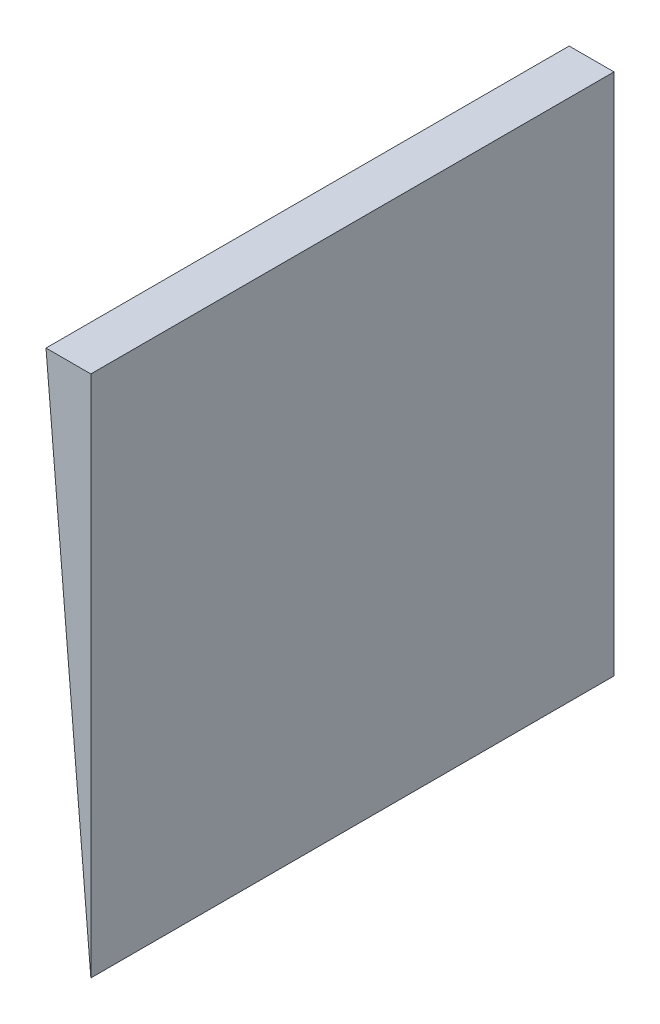
ISO-10303-21;
HEADER;
FILE_DESCRIPTION(('STEP AP214'),'2;1');
FILE_NAME('part.step','',(''),(''),'','','');
FILE_SCHEMA(('AUTOMOTIVE_DESIGN { 1 0 10303 214 1 1 1 1 }'));
ENDSEC;
DATA;
#1=APPLICATION_CONTEXT('core data for automotive mechanical design processes');
#2=APPLICATION_PROTOCOL_DEFINITION('international standard','automotive_design',2000,#1);
#3=PRODUCT_CONTEXT('',#1,'mechanical');
#4=PRODUCT('Part','Part','',(#3));
#5=PRODUCT_RELATED_PRODUCT_CATEGORY('part','',(#4));
#6=PRODUCT_DEFINITION_FORMATION('','',#4);
#7=PRODUCT_DEFINITION_CONTEXT('part definition',#1,'design');
#8=PRODUCT_DEFINITION('design','',#6,#7);
#9=PRODUCT_DEFINITION_SHAPE('','',#8);
#10=(LENGTH_UNIT() NAMED_UNIT(*) SI_UNIT(.MILLI.,.METRE.));
#11=(NAMED_UNIT(*) PLANE_ANGLE_UNIT() SI_UNIT($,.RADIAN.));
#12=(NAMED_UNIT(*) SI_UNIT($,.STERADIAN.) SOLID_ANGLE_UNIT());
#13=UNCERTAINTY_MEASURE_WITH_UNIT(LENGTH_MEASURE(1.E-05),#10,'distance_accuracy_value','');
#14=(GEOMETRIC_REPRESENTATION_CONTEXT(3) GLOBAL_UNCERTAINTY_ASSIGNED_CONTEXT((#13)) GLOBAL_UNIT_ASSIGNED_CONTEXT((#10,
#11,#12)) REPRESENTATION_CONTEXT('',''));
#15=CARTESIAN_POINT('',(0.,0.,0.));
#16=DIRECTION('',(0.,0.,1.));
#17=DIRECTION('',(1.,0.,0.));
#18=AXIS2_PLACEMENT_3D('',#15,#16,#17);
#19=CARTESIAN_POINT('',(-3.,35.,35.));
#20=DIRECTION('',(0.996346649041751,0.0854011413464358,0.));
#21=DIRECTION('',(-0.0854011413464358,0.996346649041751,0.));
#22=AXIS2_PLACEMENT_3D('',#19,#20,#21);
#23=PLANE('',#22);
#24=DIRECTION('',(0.0854011413464358,-0.996346649041751,0.));
#25=VECTOR('',#24,1.);
#26=CARTESIAN_POINT('',(-3.,35.,0.));
#27=LINE('',#26,#25);
#28=CARTESIAN_POINT('',(-3.,35.,0.));
#29=VERTEX_POINT('',#28);
#30=CARTESIAN_POINT('',(0.,0.,0.));
#31=VERTEX_POINT('',#30);
#32=EDGE_CURVE('E88',#29,#31,#27,.T.);
#33=ORIENTED_EDGE('',*,*,#32,.T.);
#34=DIRECTION('',(0.,0.,-1.));
#35=VECTOR('',#34,1.);
#36=CARTESIAN_POINT('',(0.,0.,35.));
#37=LINE('',#36,#35);
#38=CARTESIAN_POINT('',(0.,0.,35.));
#39=VERTEX_POINT('',#38);
#40=EDGE_CURVE('E11',#39,#31,#37,.T.);
#41=ORIENTED_EDGE('',*,*,#40,.F.);
#42=DIRECTION('',(0.0854011413464358,-0.996346649041751,0.));
#43=VECTOR('',#42,1.);
#44=CARTESIAN_POINT('',(-3.,35.,35.));
#45=LINE('',#44,#43);
#46=CARTESIAN_POINT('',(-3.,35.,35.));
#47=VERTEX_POINT('',#46);
#48=EDGE_CURVE('E81',#47,#39,#45,.T.);
#49=ORIENTED_EDGE('',*,*,#48,.F.);
#50=DIRECTION('',(0.,0.,-1.));
#51=VECTOR('',#50,1.);
#52=CARTESIAN_POINT('',(-3.,35.,35.));
#53=LINE('',#52,#51);
#54=EDGE_CURVE('E89',#47,#29,#53,.T.);
#55=ORIENTED_EDGE('',*,*,#54,.T.);
#56=EDGE_LOOP('',(#33,#41,#49,#55));
#57=FACE_BOUND('',#56,.T.);
#58=ADVANCED_FACE('F41',(#57),#23,.F.);
#59=CARTESIAN_POINT('',(0.,0.,35.));
#60=DIRECTION('',(-1.,0.,0.));
#61=DIRECTION('',(0.,0.,1.));
#62=AXIS2_PLACEMENT_3D('',#59,#60,#61);
#63=PLANE('',#62);
#64=DIRECTION('',(0.,1.,0.));
#65=VECTOR('',#64,1.);
#66=CARTESIAN_POINT('',(0.,0.,0.));
#67=LINE('',#66,#65);
#68=CARTESIAN_POINT('',(0.,35.,0.));
#69=VERTEX_POINT('',#68);
#70=EDGE_CURVE('E69',#31,#69,#67,.T.);
#71=ORIENTED_EDGE('',*,*,#70,.T.);
#72=DIRECTION('',(0.,0.,-1.));
#73=VECTOR('',#72,1.);
#74=CARTESIAN_POINT('',(0.,35.,35.));
#75=LINE('',#74,#73);
#76=CARTESIAN_POINT('',(0.,35.,35.));
#77=VERTEX_POINT('',#76);
#78=EDGE_CURVE('E49',#77,#69,#75,.T.);
#79=ORIENTED_EDGE('',*,*,#78,.F.);
#80=DIRECTION('',(0.,1.,0.));
#81=VECTOR('',#80,1.);
#82=CARTESIAN_POINT('',(0.,0.,35.));
#83=LINE('',#82,#81);
#84=EDGE_CURVE('E77',#39,#77,#83,.T.);
#85=ORIENTED_EDGE('',*,*,#84,.F.);
#86=ORIENTED_EDGE('',*,*,#40,.T.);
#87=EDGE_LOOP('',(#71,#79,#85,#86));
#88=FACE_BOUND('',#87,.T.);
#89=ADVANCED_FACE('F78',(#88),#63,.F.);
#90=CARTESIAN_POINT('',(0.,35.,35.));
#91=DIRECTION('',(0.,-1.,0.));
#92=DIRECTION('',(1.,0.,0.));
#93=AXIS2_PLACEMENT_3D('',#90,#91,#92);
#94=PLANE('',#93);
#95=DIRECTION('',(-1.,0.,0.));
#96=VECTOR('',#95,1.);
#97=CARTESIAN_POINT('',(0.,35.,0.));
#98=LINE('',#97,#96);
#99=EDGE_CURVE('E74',#69,#29,#98,.T.);
#100=ORIENTED_EDGE('',*,*,#99,.T.);
#101=ORIENTED_EDGE('',*,*,#54,.F.);
#102=DIRECTION('',(-1.,0.,0.));
#103=VECTOR('',#102,1.);
#104=CARTESIAN_POINT('',(0.,35.,35.));
#105=LINE('',#104,#103);
#106=EDGE_CURVE('E57',#77,#47,#105,.T.);
#107=ORIENTED_EDGE('',*,*,#106,.F.);
#108=ORIENTED_EDGE('',*,*,#78,.T.);
#109=EDGE_LOOP('',(#100,#101,#107,#108));
#110=FACE_BOUND('',#109,.T.);
#111=ADVANCED_FACE('F96',(#110),#94,.F.);
#112=CARTESIAN_POINT('',(0.,0.,35.));
#113=DIRECTION('',(0.,0.,-1.));
#114=DIRECTION('',(-1.,0.,0.));
#115=AXIS2_PLACEMENT_3D('',#112,#113,#114);
#116=PLANE('',#115);
#117=ORIENTED_EDGE('',*,*,#48,.T.);
#118=ORIENTED_EDGE('',*,*,#84,.T.);
#119=ORIENTED_EDGE('',*,*,#106,.T.);
#120=EDGE_LOOP('',(#117,#118,#119));
#121=FACE_BOUND('',#120,.T.);
#122=ADVANCED_FACE('F84',(#121),#116,.F.);
#123=CARTESIAN_POINT('',(0.,0.,0.));
#124=DIRECTION('',(0.,0.,-1.));
#125=DIRECTION('',(-1.,0.,0.));
#126=AXIS2_PLACEMENT_3D('',#123,#124,#125);
#127=PLANE('',#126);
#128=ORIENTED_EDGE('',*,*,#32,.F.);
#129=ORIENTED_EDGE('',*,*,#99,.F.);
#130=ORIENTED_EDGE('',*,*,#70,.F.);
#131=EDGE_LOOP('',(#128,#129,#130));
#132=FACE_BOUND('',#131,.T.);
#133=ADVANCED_FACE('F97',(#132),#127,.T.);
#134=CLOSED_SHELL('',(#58,#89,#111,#122,#133));
#135=MANIFOLD_SOLID_BREP('B2',#134);
#136=ADVANCED_BREP_SHAPE_REPRESENTATION('',(#18,#135),#14);
#137=SHAPE_DEFINITION_REPRESENTATION(#9,#136);
ENDSEC;
END-ISO-10303-21;
